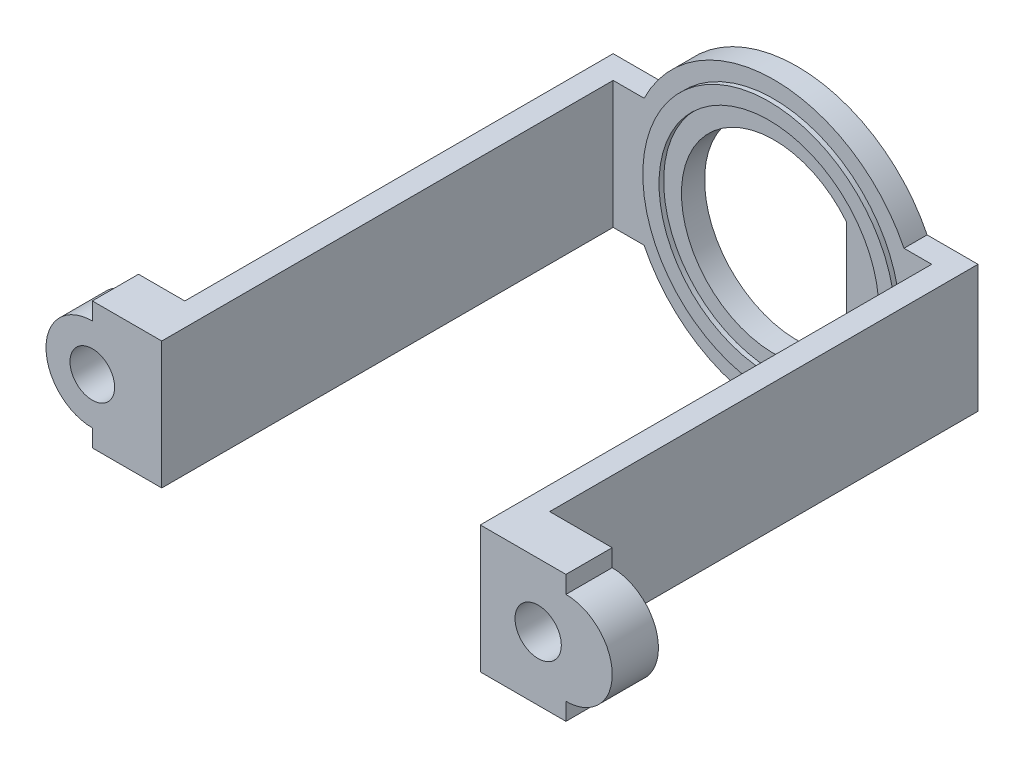
ISO-10303-21;
HEADER;
FILE_DESCRIPTION(('STEP AP214'),'2;1');
FILE_NAME('part.step','',(''),(''),'','','');
FILE_SCHEMA(('AUTOMOTIVE_DESIGN { 1 0 10303 214 1 1 1 1 }'));
ENDSEC;
DATA;
#1=APPLICATION_CONTEXT('core data for automotive mechanical design processes');
#2=APPLICATION_PROTOCOL_DEFINITION('international standard','automotive_design',2000,#1);
#3=PRODUCT_CONTEXT('',#1,'mechanical');
#4=PRODUCT('Part','Part','',(#3));
#5=PRODUCT_RELATED_PRODUCT_CATEGORY('part','',(#4));
#6=PRODUCT_DEFINITION_FORMATION('','',#4);
#7=PRODUCT_DEFINITION_CONTEXT('part definition',#1,'design');
#8=PRODUCT_DEFINITION('design','',#6,#7);
#9=PRODUCT_DEFINITION_SHAPE('','',#8);
#10=(LENGTH_UNIT() NAMED_UNIT(*) SI_UNIT(.MILLI.,.METRE.));
#11=(NAMED_UNIT(*) PLANE_ANGLE_UNIT() SI_UNIT($,.RADIAN.));
#12=(NAMED_UNIT(*) SI_UNIT($,.STERADIAN.) SOLID_ANGLE_UNIT());
#13=UNCERTAINTY_MEASURE_WITH_UNIT(LENGTH_MEASURE(1.E-05),#10,'distance_accuracy_value','');
#14=(GEOMETRIC_REPRESENTATION_CONTEXT(3) GLOBAL_UNCERTAINTY_ASSIGNED_CONTEXT((#13)) GLOBAL_UNIT_ASSIGNED_CONTEXT((#10,
#11,#12)) REPRESENTATION_CONTEXT('',''));
#15=CARTESIAN_POINT('',(0.,0.,0.));
#16=DIRECTION('',(0.,0.,1.));
#17=DIRECTION('',(1.,0.,0.));
#18=AXIS2_PLACEMENT_3D('',#15,#16,#17);
#19=CARTESIAN_POINT('',(0.,0.,1.27));
#20=DIRECTION('',(0.,0.,1.));
#21=DIRECTION('',(1.,0.,0.));
#22=AXIS2_PLACEMENT_3D('',#19,#20,#21);
#23=PLANE('',#22);
#24=DIRECTION('',(1.,0.,0.));
#25=VECTOR('',#24,1.);
#26=CARTESIAN_POINT('',(0.,-6.985,1.27));
#27=LINE('',#26,#25);
#28=CARTESIAN_POINT('',(17.2243573218044,-6.985,1.27));
#29=VERTEX_POINT('',#28);
#30=CARTESIAN_POINT('',(18.7452,-6.985,1.27));
#31=VERTEX_POINT('',#30);
#32=EDGE_CURVE('E328',#29,#31,#27,.T.);
#33=ORIENTED_EDGE('',*,*,#32,.T.);
#34=DIRECTION('',(0.,-1.,0.));
#35=VECTOR('',#34,1.);
#36=CARTESIAN_POINT('',(18.7452,0.,1.27));
#37=LINE('',#36,#35);
#38=CARTESIAN_POINT('',(18.7452,0.,1.27));
#39=VERTEX_POINT('',#38);
#40=EDGE_CURVE('E277',#39,#31,#37,.T.);
#41=ORIENTED_EDGE('',*,*,#40,.F.);
#42=DIRECTION('',(-1.,0.,0.));
#43=VECTOR('',#42,1.);
#44=CARTESIAN_POINT('',(0.,0.,1.27));
#45=LINE('',#44,#43);
#46=CARTESIAN_POINT('',(17.2243573218044,0.,1.27));
#47=VERTEX_POINT('',#46);
#48=EDGE_CURVE('E326',#39,#47,#45,.T.);
#49=ORIENTED_EDGE('',*,*,#48,.T.);
#50=CARTESIAN_POINT('',(10.0965,-3.4925,1.27));
#51=DIRECTION('',(0.,0.,-1.));
#52=DIRECTION('',(-1.,0.,0.));
#53=AXIS2_PLACEMENT_3D('',#50,#51,#52);
#54=CIRCLE('',#53,7.9375);
#55=CARTESIAN_POINT('',(2.96864267819564,0.,1.27));
#56=VERTEX_POINT('',#55);
#57=EDGE_CURVE('E406',#56,#47,#54,.T.);
#58=ORIENTED_EDGE('',*,*,#57,.F.);
#59=CARTESIAN_POINT('',(1.27,0.,1.27));
#60=VERTEX_POINT('',#59);
#61=EDGE_CURVE('E324',#56,#60,#45,.T.);
#62=ORIENTED_EDGE('',*,*,#61,.T.);
#63=DIRECTION('',(0.,1.,0.));
#64=VECTOR('',#63,1.);
#65=CARTESIAN_POINT('',(1.27,0.,1.27));
#66=LINE('',#65,#64);
#67=CARTESIAN_POINT('',(1.27,-6.985,1.27));
#68=VERTEX_POINT('',#67);
#69=EDGE_CURVE('E290',#68,#60,#66,.T.);
#70=ORIENTED_EDGE('',*,*,#69,.F.);
#71=CARTESIAN_POINT('',(2.96864267819564,-6.985,1.27));
#72=VERTEX_POINT('',#71);
#73=EDGE_CURVE('E299',#68,#72,#27,.T.);
#74=ORIENTED_EDGE('',*,*,#73,.T.);
#75=EDGE_CURVE('E405',#29,#72,#54,.T.);
#76=ORIENTED_EDGE('',*,*,#75,.F.);
#77=EDGE_LOOP('',(#33,#41,#49,#58,#62,#70,#74,#76));
#78=FACE_BOUND('',#77,.T.);
#79=CARTESIAN_POINT('',(10.0725111111111,-3.39372222222231,1.27));
#80=DIRECTION('',(0.,0.,1.));
#81=DIRECTION('',(1.,0.,0.));
#82=AXIS2_PLACEMENT_3D('',#79,#80,#81);
#83=CIRCLE('',#82,6.9215);
#84=CARTESIAN_POINT('',(16.9940111111111,-3.39372222222231,1.27));
#85=VERTEX_POINT('',#84);
#86=EDGE_CURVE('E823',#85,#85,#83,.T.);
#87=ORIENTED_EDGE('',*,*,#86,.F.);
#88=EDGE_LOOP('',(#87));
#89=FACE_BOUND('',#88,.T.);
#90=ADVANCED_FACE('F35',(#78,#89),#23,.T.);
#91=CARTESIAN_POINT('',(0.,-6.985,1.27));
#92=DIRECTION('',(0.,1.,0.));
#93=DIRECTION('',(-1.,0.,0.));
#94=AXIS2_PLACEMENT_3D('',#91,#92,#93);
#95=PLANE('',#94);
#96=DIRECTION('',(0.,0.,-1.));
#97=VECTOR('',#96,1.);
#98=CARTESIAN_POINT('',(23.4442,-6.985,112.990742134563));
#99=LINE('',#98,#97);
#100=CARTESIAN_POINT('',(23.4442,-6.985,26.035));
#101=VERTEX_POINT('',#100);
#102=CARTESIAN_POINT('',(23.4442,-6.985,23.4995854901961));
#103=VERTEX_POINT('',#102);
#104=EDGE_CURVE('E198',#101,#103,#99,.T.);
#105=ORIENTED_EDGE('',*,*,#104,.F.);
#106=DIRECTION('',(1.,0.,0.));
#107=VECTOR('',#106,1.);
#108=CARTESIAN_POINT('',(20.0152,-6.985,26.035));
#109=LINE('',#108,#107);
#110=CARTESIAN_POINT('',(18.7452,-6.985,26.035));
#111=VERTEX_POINT('',#110);
#112=EDGE_CURVE('E279',#111,#101,#109,.T.);
#113=ORIENTED_EDGE('',*,*,#112,.F.);
#114=DIRECTION('',(0.,0.,-1.));
#115=VECTOR('',#114,1.);
#116=CARTESIAN_POINT('',(18.7452,-6.985,26.035));
#117=LINE('',#116,#115);
#118=EDGE_CURVE('E286',#111,#31,#117,.T.);
#119=ORIENTED_EDGE('',*,*,#118,.T.);
#120=ORIENTED_EDGE('',*,*,#32,.F.);
#121=DIRECTION('',(0.,0.,-1.));
#122=VECTOR('',#121,1.);
#123=CARTESIAN_POINT('',(17.2243573218044,-6.985,1.27));
#124=LINE('',#123,#122);
#125=CARTESIAN_POINT('',(17.2243573218044,-6.985,0.));
#126=VERTEX_POINT('',#125);
#127=EDGE_CURVE('E417',#29,#126,#124,.T.);
#128=ORIENTED_EDGE('',*,*,#127,.T.);
#129=DIRECTION('',(1.,0.,0.));
#130=VECTOR('',#129,1.);
#131=CARTESIAN_POINT('',(0.,-6.985,0.));
#132=LINE('',#131,#130);
#133=CARTESIAN_POINT('',(20.0152,-6.985,0.));
#134=VERTEX_POINT('',#133);
#135=EDGE_CURVE('E421',#126,#134,#132,.T.);
#136=ORIENTED_EDGE('',*,*,#135,.T.);
#137=DIRECTION('',(0.,0.,-1.));
#138=VECTOR('',#137,1.);
#139=CARTESIAN_POINT('',(20.0152,-6.985,1.27));
#140=LINE('',#139,#138);
#141=CARTESIAN_POINT('',(20.0152,-6.985,23.4995854901961));
#142=VERTEX_POINT('',#141);
#143=EDGE_CURVE('E249',#142,#134,#140,.T.);
#144=ORIENTED_EDGE('',*,*,#143,.F.);
#145=DIRECTION('',(-1.,0.,0.));
#146=VECTOR('',#145,1.);
#147=CARTESIAN_POINT('',(25.9842,-6.985,23.4995854901961));
#148=LINE('',#147,#146);
#149=EDGE_CURVE('E259',#103,#142,#148,.T.);
#150=ORIENTED_EDGE('',*,*,#149,.F.);
#151=EDGE_LOOP('',(#105,#113,#119,#120,#128,#136,#144,#150));
#152=FACE_BOUND('',#151,.T.);
#153=ADVANCED_FACE('F443',(#152),#95,.F.);
#154=CARTESIAN_POINT('',(0.,0.,1.27));
#155=DIRECTION('',(0.,-1.,0.));
#156=DIRECTION('',(0.,0.,-1.));
#157=AXIS2_PLACEMENT_3D('',#154,#155,#156);
#158=PLANE('',#157);
#159=DIRECTION('',(0.,0.,-1.));
#160=VECTOR('',#159,1.);
#161=CARTESIAN_POINT('',(23.4442,0.,112.990742134563));
#162=LINE('',#161,#160);
#163=CARTESIAN_POINT('',(23.4442,0.,26.035));
#164=VERTEX_POINT('',#163);
#165=CARTESIAN_POINT('',(23.4442,0.,23.4995854901961));
#166=VERTEX_POINT('',#165);
#167=EDGE_CURVE('E190',#164,#166,#162,.T.);
#168=ORIENTED_EDGE('',*,*,#167,.T.);
#169=DIRECTION('',(-1.,0.,0.));
#170=VECTOR('',#169,1.);
#171=CARTESIAN_POINT('',(25.9842,0.,23.4995854901961));
#172=LINE('',#171,#170);
#173=CARTESIAN_POINT('',(20.0152,0.,23.4995854901961));
#174=VERTEX_POINT('',#173);
#175=EDGE_CURVE('E248',#166,#174,#172,.T.);
#176=ORIENTED_EDGE('',*,*,#175,.T.);
#177=DIRECTION('',(0.,0.,-1.));
#178=VECTOR('',#177,1.);
#179=CARTESIAN_POINT('',(20.0152,0.,1.27));
#180=LINE('',#179,#178);
#181=CARTESIAN_POINT('',(20.0152,0.,0.));
#182=VERTEX_POINT('',#181);
#183=EDGE_CURVE('E333',#174,#182,#180,.T.);
#184=ORIENTED_EDGE('',*,*,#183,.T.);
#185=DIRECTION('',(-1.,0.,0.));
#186=VECTOR('',#185,1.);
#187=CARTESIAN_POINT('',(0.,0.,0.));
#188=LINE('',#187,#186);
#189=CARTESIAN_POINT('',(17.2243573218044,0.,0.));
#190=VERTEX_POINT('',#189);
#191=EDGE_CURVE('E426',#182,#190,#188,.T.);
#192=ORIENTED_EDGE('',*,*,#191,.T.);
#193=DIRECTION('',(0.,0.,-1.));
#194=VECTOR('',#193,1.);
#195=CARTESIAN_POINT('',(17.2243573218044,0.,1.27));
#196=LINE('',#195,#194);
#197=EDGE_CURVE('E409',#190,#47,#196,.F.);
#198=ORIENTED_EDGE('',*,*,#197,.T.);
#199=ORIENTED_EDGE('',*,*,#48,.F.);
#200=DIRECTION('',(0.,0.,-1.));
#201=VECTOR('',#200,1.);
#202=CARTESIAN_POINT('',(18.7452,0.,26.035));
#203=LINE('',#202,#201);
#204=CARTESIAN_POINT('',(18.7452,0.,26.035));
#205=VERTEX_POINT('',#204);
#206=EDGE_CURVE('E274',#205,#39,#203,.T.);
#207=ORIENTED_EDGE('',*,*,#206,.F.);
#208=DIRECTION('',(-1.,0.,0.));
#209=VECTOR('',#208,1.);
#210=CARTESIAN_POINT('',(20.0152,0.,26.035));
#211=LINE('',#210,#209);
#212=EDGE_CURVE('E268',#164,#205,#211,.T.);
#213=ORIENTED_EDGE('',*,*,#212,.F.);
#214=EDGE_LOOP('',(#168,#176,#184,#192,#198,#199,#207,#213));
#215=FACE_BOUND('',#214,.T.);
#216=ADVANCED_FACE('F271',(#215),#158,.F.);
#217=CARTESIAN_POINT('',(20.0152,-6.985,26.035));
#218=DIRECTION('',(0.,0.,-1.));
#219=DIRECTION('',(-1.,0.,0.));
#220=AXIS2_PLACEMENT_3D('',#217,#218,#219);
#221=PLANE('',#220);
#222=CARTESIAN_POINT('',(21.9202,-3.4925,26.035));
#223=DIRECTION('',(0.,0.,1.));
#224=DIRECTION('',(1.,0.,0.));
#225=AXIS2_PLACEMENT_3D('',#222,#223,#224);
#226=CIRCLE('',#225,1.27);
#227=CARTESIAN_POINT('',(23.1902,-3.4925,26.035));
#228=VERTEX_POINT('',#227);
#229=EDGE_CURVE('E207',#228,#228,#226,.T.);
#230=ORIENTED_EDGE('',*,*,#229,.F.);
#231=EDGE_LOOP('',(#230));
#232=FACE_BOUND('',#231,.T.);
#233=DIRECTION('',(0.,-1.,0.));
#234=VECTOR('',#233,1.);
#235=CARTESIAN_POINT('',(23.4442,-6.985,26.035));
#236=LINE('',#235,#234);
#237=CARTESIAN_POINT('',(23.4442,-0.9525,26.035));
#238=VERTEX_POINT('',#237);
#239=EDGE_CURVE('E215',#164,#238,#236,.T.);
#240=ORIENTED_EDGE('',*,*,#239,.F.);
#241=ORIENTED_EDGE('',*,*,#212,.T.);
#242=DIRECTION('',(0.,-1.,0.));
#243=VECTOR('',#242,1.);
#244=CARTESIAN_POINT('',(18.7452,0.,26.035));
#245=LINE('',#244,#243);
#246=EDGE_CURVE('E276',#205,#111,#245,.T.);
#247=ORIENTED_EDGE('',*,*,#246,.T.);
#248=ORIENTED_EDGE('',*,*,#112,.T.);
#249=DIRECTION('',(0.,-1.,0.));
#250=VECTOR('',#249,1.);
#251=CARTESIAN_POINT('',(23.4442,-6.985,26.035));
#252=LINE('',#251,#250);
#253=CARTESIAN_POINT('',(23.4442,-6.0325,26.035));
#254=VERTEX_POINT('',#253);
#255=EDGE_CURVE('E213',#254,#101,#252,.T.);
#256=ORIENTED_EDGE('',*,*,#255,.F.);
#257=CARTESIAN_POINT('',(23.4442,-3.4925,26.035));
#258=DIRECTION('',(0.,0.,-1.));
#259=DIRECTION('',(-1.,0.,0.));
#260=AXIS2_PLACEMENT_3D('',#257,#258,#259);
#261=CIRCLE('',#260,2.54);
#262=EDGE_CURVE('E50',#238,#254,#261,.T.);
#263=ORIENTED_EDGE('',*,*,#262,.F.);
#264=EDGE_LOOP('',(#240,#241,#247,#248,#256,#263));
#265=FACE_BOUND('',#264,.T.);
#266=ADVANCED_FACE('F267',(#232,#265),#221,.F.);
#267=CARTESIAN_POINT('',(25.9842,0.,23.4995854901961));
#268=DIRECTION('',(0.,0.,1.));
#269=DIRECTION('',(1.,0.,0.));
#270=AXIS2_PLACEMENT_3D('',#267,#268,#269);
#271=PLANE('',#270);
#272=CARTESIAN_POINT('',(21.9202,-3.4925,23.4995854901961));
#273=DIRECTION('',(0.,0.,1.));
#274=DIRECTION('',(1.,0.,0.));
#275=AXIS2_PLACEMENT_3D('',#272,#273,#274);
#276=CIRCLE('',#275,1.27);
#277=CARTESIAN_POINT('',(23.1902,-3.4925,23.4995854901961));
#278=VERTEX_POINT('',#277);
#279=EDGE_CURVE('E202',#278,#278,#276,.T.);
#280=ORIENTED_EDGE('',*,*,#279,.T.);
#281=EDGE_LOOP('',(#280));
#282=FACE_BOUND('',#281,.T.);
#283=DIRECTION('',(0.,1.,0.));
#284=VECTOR('',#283,1.);
#285=CARTESIAN_POINT('',(23.4442,0.,23.4995854901961));
#286=LINE('',#285,#284);
#287=CARTESIAN_POINT('',(23.4442,-0.9525,23.4995854901961));
#288=VERTEX_POINT('',#287);
#289=EDGE_CURVE('E43',#288,#166,#286,.T.);
#290=ORIENTED_EDGE('',*,*,#289,.F.);
#291=CARTESIAN_POINT('',(23.4442,-3.4925,23.4995854901961));
#292=DIRECTION('',(0.,0.,1.));
#293=DIRECTION('',(1.,0.,0.));
#294=AXIS2_PLACEMENT_3D('',#291,#292,#293);
#295=CIRCLE('',#294,2.54);
#296=CARTESIAN_POINT('',(23.4442,-6.0325,23.4995854901961));
#297=VERTEX_POINT('',#296);
#298=EDGE_CURVE('E182',#297,#288,#295,.T.);
#299=ORIENTED_EDGE('',*,*,#298,.F.);
#300=DIRECTION('',(0.,1.,0.));
#301=VECTOR('',#300,1.);
#302=CARTESIAN_POINT('',(23.4442,0.,23.4995854901961));
#303=LINE('',#302,#301);
#304=EDGE_CURVE('E185',#103,#297,#303,.T.);
#305=ORIENTED_EDGE('',*,*,#304,.F.);
#306=ORIENTED_EDGE('',*,*,#149,.T.);
#307=DIRECTION('',(0.,1.,0.));
#308=VECTOR('',#307,1.);
#309=CARTESIAN_POINT('',(20.0152,0.,23.4995854901961));
#310=LINE('',#309,#308);
#311=EDGE_CURVE('E239',#142,#174,#310,.T.);
#312=ORIENTED_EDGE('',*,*,#311,.T.);
#313=ORIENTED_EDGE('',*,*,#175,.F.);
#314=EDGE_LOOP('',(#290,#299,#305,#306,#312,#313));
#315=FACE_BOUND('',#314,.T.);
#316=ADVANCED_FACE('F184',(#282,#315),#271,.F.);
#317=CARTESIAN_POINT('',(20.0152,0.,1.27));
#318=DIRECTION('',(-1.,0.,0.));
#319=DIRECTION('',(0.,0.,1.));
#320=AXIS2_PLACEMENT_3D('',#317,#318,#319);
#321=PLANE('',#320);
#322=ORIENTED_EDGE('',*,*,#311,.F.);
#323=ORIENTED_EDGE('',*,*,#143,.T.);
#324=DIRECTION('',(0.,1.,0.));
#325=VECTOR('',#324,1.);
#326=CARTESIAN_POINT('',(20.0152,0.,0.));
#327=LINE('',#326,#325);
#328=EDGE_CURVE('E424',#134,#182,#327,.T.);
#329=ORIENTED_EDGE('',*,*,#328,.T.);
#330=ORIENTED_EDGE('',*,*,#183,.F.);
#331=EDGE_LOOP('',(#322,#323,#329,#330));
#332=FACE_BOUND('',#331,.T.);
#333=ADVANCED_FACE('F483',(#332),#321,.F.);
#334=CARTESIAN_POINT('',(0.,0.,1.27));
#335=DIRECTION('',(1.,0.,0.));
#336=DIRECTION('',(0.,1.,0.));
#337=AXIS2_PLACEMENT_3D('',#334,#335,#336);
#338=PLANE('',#337);
#339=DIRECTION('',(0.,-1.,0.));
#340=VECTOR('',#339,1.);
#341=CARTESIAN_POINT('',(0.,0.,23.4995879248366));
#342=LINE('',#341,#340);
#343=CARTESIAN_POINT('',(0.,0.,23.4995879248366));
#344=VERTEX_POINT('',#343);
#345=CARTESIAN_POINT('',(0.,-6.985,23.4995879248366));
#346=VERTEX_POINT('',#345);
#347=EDGE_CURVE('E261',#344,#346,#342,.T.);
#348=ORIENTED_EDGE('',*,*,#347,.F.);
#349=DIRECTION('',(0.,0.,-1.));
#350=VECTOR('',#349,1.);
#351=CARTESIAN_POINT('',(0.,0.,1.27));
#352=LINE('',#351,#350);
#353=CARTESIAN_POINT('',(0.,0.,0.));
#354=VERTEX_POINT('',#353);
#355=EDGE_CURVE('E318',#344,#354,#352,.T.);
#356=ORIENTED_EDGE('',*,*,#355,.T.);
#357=DIRECTION('',(0.,-1.,0.));
#358=VECTOR('',#357,1.);
#359=CARTESIAN_POINT('',(0.,0.,0.));
#360=LINE('',#359,#358);
#361=CARTESIAN_POINT('',(0.,-6.985,0.));
#362=VERTEX_POINT('',#361);
#363=EDGE_CURVE('E365',#354,#362,#360,.T.);
#364=ORIENTED_EDGE('',*,*,#363,.T.);
#365=DIRECTION('',(0.,0.,-1.));
#366=VECTOR('',#365,1.);
#367=CARTESIAN_POINT('',(0.,-6.985,1.27));
#368=LINE('',#367,#366);
#369=EDGE_CURVE('E314',#346,#362,#368,.T.);
#370=ORIENTED_EDGE('',*,*,#369,.F.);
#371=EDGE_LOOP('',(#348,#356,#364,#370));
#372=FACE_BOUND('',#371,.T.);
#373=ADVANCED_FACE('F37',(#372),#338,.F.);
#374=CARTESIAN_POINT('',(10.0725111111111,-3.39372222222231,1.27));
#375=DIRECTION('',(0.,0.,1.));
#376=DIRECTION('',(1.,0.,0.));
#377=AXIS2_PLACEMENT_3D('',#374,#375,#376);
#378=CIRCLE('',#377,6.0325);
#379=CARTESIAN_POINT('',(16.1050111111111,-3.39372222222231,1.27));
#380=VERTEX_POINT('',#379);
#381=EDGE_CURVE('E11',#380,#380,#378,.F.);
#382=ORIENTED_EDGE('',*,*,#381,.F.);
#383=EDGE_LOOP('',(#382));
#384=FACE_BOUND('',#383,.T.);
#385=CARTESIAN_POINT('',(10.0965,-3.4925,1.27));
#386=DIRECTION('',(0.,0.,1.));
#387=DIRECTION('',(1.,0.,0.));
#388=AXIS2_PLACEMENT_3D('',#385,#386,#387);
#389=CIRCLE('',#388,5.08);
#390=CARTESIAN_POINT('',(14.062073728983,-0.317500000000002,1.27));
#391=VERTEX_POINT('',#390);
#392=CARTESIAN_POINT('',(14.062073728983,-6.6675,1.27));
#393=VERTEX_POINT('',#392);
#394=EDGE_CURVE('E398',#391,#393,#389,.T.);
#395=ORIENTED_EDGE('',*,*,#394,.F.);
#396=DIRECTION('',(0.,1.,0.));
#397=VECTOR('',#396,1.);
#398=CARTESIAN_POINT('',(14.062073728983,0.,1.27));
#399=LINE('',#398,#397);
#400=EDGE_CURVE('E394',#393,#391,#399,.T.);
#401=ORIENTED_EDGE('',*,*,#400,.F.);
#402=EDGE_LOOP('',(#395,#401));
#403=FACE_BOUND('',#402,.T.);
#404=ADVANCED_FACE('F471',(#384,#403),#23,.T.);
#405=DIRECTION('',(1.,0.,0.));
#406=VECTOR('',#405,1.);
#407=CARTESIAN_POINT('',(-5.08,0.,23.4995879248366));
#408=LINE('',#407,#406);
#409=CARTESIAN_POINT('',(-2.53999999999999,0.,23.4995879248366));
#410=VERTEX_POINT('',#409);
#411=EDGE_CURVE('E282',#410,#344,#408,.T.);
#412=ORIENTED_EDGE('',*,*,#411,.F.);
#413=DIRECTION('',(0.,0.,-1.));
#414=VECTOR('',#413,1.);
#415=CARTESIAN_POINT('',(-2.53999999999999,0.,112.990764435649));
#416=LINE('',#415,#414);
#417=CARTESIAN_POINT('',(-2.53999999999999,0.,26.035));
#418=VERTEX_POINT('',#417);
#419=EDGE_CURVE('E227',#418,#410,#416,.T.);
#420=ORIENTED_EDGE('',*,*,#419,.F.);
#421=DIRECTION('',(-1.,0.,0.));
#422=VECTOR('',#421,1.);
#423=CARTESIAN_POINT('',(0.,0.,26.035));
#424=LINE('',#423,#422);
#425=CARTESIAN_POINT('',(1.27,0.,26.035));
#426=VERTEX_POINT('',#425);
#427=EDGE_CURVE('E306',#426,#418,#424,.T.);
#428=ORIENTED_EDGE('',*,*,#427,.F.);
#429=DIRECTION('',(0.,0.,-1.));
#430=VECTOR('',#429,1.);
#431=CARTESIAN_POINT('',(1.27,0.,26.035));
#432=LINE('',#431,#430);
#433=EDGE_CURVE('E302',#426,#60,#432,.T.);
#434=ORIENTED_EDGE('',*,*,#433,.T.);
#435=ORIENTED_EDGE('',*,*,#61,.F.);
#436=DIRECTION('',(0.,0.,-1.));
#437=VECTOR('',#436,1.);
#438=CARTESIAN_POINT('',(2.96864267819564,0.,1.27));
#439=LINE('',#438,#437);
#440=CARTESIAN_POINT('',(2.96864267819564,0.,0.));
#441=VERTEX_POINT('',#440);
#442=EDGE_CURVE('E412',#56,#441,#439,.T.);
#443=ORIENTED_EDGE('',*,*,#442,.T.);
#444=EDGE_CURVE('E360',#441,#354,#188,.T.);
#445=ORIENTED_EDGE('',*,*,#444,.T.);
#446=ORIENTED_EDGE('',*,*,#355,.F.);
#447=EDGE_LOOP('',(#412,#420,#428,#434,#435,#443,#445,#446));
#448=FACE_BOUND('',#447,.T.);
#449=ADVANCED_FACE('F355',(#448),#158,.F.);
#450=DIRECTION('',(1.,0.,0.));
#451=VECTOR('',#450,1.);
#452=CARTESIAN_POINT('',(0.,-6.985,26.035));
#453=LINE('',#452,#451);
#454=CARTESIAN_POINT('',(-2.53999999999999,-6.98500000000001,26.035));
#455=VERTEX_POINT('',#454);
#456=CARTESIAN_POINT('',(1.27,-6.985,26.035));
#457=VERTEX_POINT('',#456);
#458=EDGE_CURVE('E293',#455,#457,#453,.T.);
#459=ORIENTED_EDGE('',*,*,#458,.F.);
#460=DIRECTION('',(0.,0.,-1.));
#461=VECTOR('',#460,1.);
#462=CARTESIAN_POINT('',(-2.53999999999999,-6.98500000000001,112.990764435649));
#463=LINE('',#462,#461);
#464=CARTESIAN_POINT('',(-2.53999999999999,-6.98500000000001,23.4995879248366));
#465=VERTEX_POINT('',#464);
#466=EDGE_CURVE('E221',#455,#465,#463,.T.);
#467=ORIENTED_EDGE('',*,*,#466,.T.);
#468=DIRECTION('',(1.,0.,0.));
#469=VECTOR('',#468,1.);
#470=CARTESIAN_POINT('',(-5.08,-6.985,23.4995879248366));
#471=LINE('',#470,#469);
#472=EDGE_CURVE('E340',#465,#346,#471,.T.);
#473=ORIENTED_EDGE('',*,*,#472,.T.);
#474=ORIENTED_EDGE('',*,*,#369,.T.);
#475=CARTESIAN_POINT('',(2.96864267819564,-6.985,0.));
#476=VERTEX_POINT('',#475);
#477=EDGE_CURVE('E422',#362,#476,#132,.T.);
#478=ORIENTED_EDGE('',*,*,#477,.T.);
#479=DIRECTION('',(0.,0.,-1.));
#480=VECTOR('',#479,1.);
#481=CARTESIAN_POINT('',(2.96864267819564,-6.985,1.27));
#482=LINE('',#481,#480);
#483=EDGE_CURVE('E414',#476,#72,#482,.F.);
#484=ORIENTED_EDGE('',*,*,#483,.T.);
#485=ORIENTED_EDGE('',*,*,#73,.F.);
#486=DIRECTION('',(0.,0.,-1.));
#487=VECTOR('',#486,1.);
#488=CARTESIAN_POINT('',(1.27,-6.985,26.035));
#489=LINE('',#488,#487);
#490=EDGE_CURVE('E305',#457,#68,#489,.T.);
#491=ORIENTED_EDGE('',*,*,#490,.F.);
#492=EDGE_LOOP('',(#459,#467,#473,#474,#478,#484,#485,#491));
#493=FACE_BOUND('',#492,.T.);
#494=ADVANCED_FACE('F369',(#493),#95,.F.);
#495=CARTESIAN_POINT('',(0.,0.,0.));
#496=DIRECTION('',(0.,0.,1.));
#497=DIRECTION('',(1.,0.,0.));
#498=AXIS2_PLACEMENT_3D('',#495,#496,#497);
#499=PLANE('',#498);
#500=DIRECTION('',(0.,-1.,0.));
#501=VECTOR('',#500,1.);
#502=CARTESIAN_POINT('',(14.062073728983,-0.317500000000002,0.));
#503=LINE('',#502,#501);
#504=CARTESIAN_POINT('',(14.062073728983,-0.317500000000002,0.));
#505=VERTEX_POINT('',#504);
#506=CARTESIAN_POINT('',(14.062073728983,-6.6675,0.));
#507=VERTEX_POINT('',#506);
#508=EDGE_CURVE('E388',#505,#507,#503,.T.);
#509=ORIENTED_EDGE('',*,*,#508,.F.);
#510=CARTESIAN_POINT('',(10.0965,-3.4925,0.));
#511=DIRECTION('',(0.,0.,-1.));
#512=DIRECTION('',(1.,0.,0.));
#513=AXIS2_PLACEMENT_3D('',#510,#511,#512);
#514=CIRCLE('',#513,5.08);
#515=EDGE_CURVE('E311',#507,#505,#514,.T.);
#516=ORIENTED_EDGE('',*,*,#515,.F.);
#517=EDGE_LOOP('',(#509,#516));
#518=FACE_BOUND('',#517,.T.);
#519=ORIENTED_EDGE('',*,*,#135,.F.);
#520=CARTESIAN_POINT('',(10.0965,-3.4925,0.));
#521=DIRECTION('',(0.,0.,-1.));
#522=DIRECTION('',(-1.,0.,0.));
#523=AXIS2_PLACEMENT_3D('',#520,#521,#522);
#524=CIRCLE('',#523,7.9375);
#525=EDGE_CURVE('E401',#126,#476,#524,.T.);
#526=ORIENTED_EDGE('',*,*,#525,.T.);
#527=ORIENTED_EDGE('',*,*,#477,.F.);
#528=ORIENTED_EDGE('',*,*,#363,.F.);
#529=ORIENTED_EDGE('',*,*,#444,.F.);
#530=EDGE_CURVE('E402',#441,#190,#524,.T.);
#531=ORIENTED_EDGE('',*,*,#530,.T.);
#532=ORIENTED_EDGE('',*,*,#191,.F.);
#533=ORIENTED_EDGE('',*,*,#328,.F.);
#534=EDGE_LOOP('',(#519,#526,#527,#528,#529,#531,#532,#533));
#535=FACE_BOUND('',#534,.T.);
#536=ADVANCED_FACE('F493',(#518,#535),#499,.F.);
#537=CARTESIAN_POINT('',(10.0965,-3.4925,1.27));
#538=DIRECTION('',(0.,0.,-1.));
#539=DIRECTION('',(-1.,0.,0.));
#540=AXIS2_PLACEMENT_3D('',#537,#538,#539);
#541=CYLINDRICAL_SURFACE('',#540,7.9375);
#542=ORIENTED_EDGE('',*,*,#442,.F.);
#543=ORIENTED_EDGE('',*,*,#57,.T.);
#544=ORIENTED_EDGE('',*,*,#197,.F.);
#545=ORIENTED_EDGE('',*,*,#530,.F.);
#546=EDGE_LOOP('',(#542,#543,#544,#545));
#547=FACE_BOUND('',#546,.T.);
#548=ADVANCED_FACE('F454',(#547),#541,.T.);
#549=ORIENTED_EDGE('',*,*,#127,.F.);
#550=ORIENTED_EDGE('',*,*,#75,.T.);
#551=ORIENTED_EDGE('',*,*,#483,.F.);
#552=ORIENTED_EDGE('',*,*,#525,.F.);
#553=EDGE_LOOP('',(#549,#550,#551,#552));
#554=FACE_BOUND('',#553,.T.);
#555=ADVANCED_FACE('F440',(#554),#541,.T.);
#556=CARTESIAN_POINT('',(10.0965,-3.4925,2.54));
#557=DIRECTION('',(0.,0.,-1.));
#558=DIRECTION('',(-1.,0.,0.));
#559=AXIS2_PLACEMENT_3D('',#556,#557,#558);
#560=CYLINDRICAL_SURFACE('',#559,5.08);
#561=ORIENTED_EDGE('',*,*,#394,.T.);
#562=DIRECTION('',(0.,0.,-1.));
#563=VECTOR('',#562,1.);
#564=CARTESIAN_POINT('',(14.062073728983,-6.6675,2.54));
#565=LINE('',#564,#563);
#566=EDGE_CURVE('E392',#393,#507,#565,.T.);
#567=ORIENTED_EDGE('',*,*,#566,.T.);
#568=ORIENTED_EDGE('',*,*,#515,.T.);
#569=DIRECTION('',(0.,0.,-1.));
#570=VECTOR('',#569,1.);
#571=CARTESIAN_POINT('',(14.062073728983,-0.317500000000002,2.54));
#572=LINE('',#571,#570);
#573=EDGE_CURVE('E391',#391,#505,#572,.T.);
#574=ORIENTED_EDGE('',*,*,#573,.F.);
#575=EDGE_LOOP('',(#561,#567,#568,#574));
#576=FACE_BOUND('',#575,.T.);
#577=ADVANCED_FACE('F466',(#576),#560,.F.);
#578=CARTESIAN_POINT('',(14.062073728983,-0.317500000000002,2.54));
#579=DIRECTION('',(1.,0.,0.));
#580=DIRECTION('',(0.,0.,-1.));
#581=AXIS2_PLACEMENT_3D('',#578,#579,#580);
#582=PLANE('',#581);
#583=ORIENTED_EDGE('',*,*,#400,.T.);
#584=ORIENTED_EDGE('',*,*,#573,.T.);
#585=ORIENTED_EDGE('',*,*,#508,.T.);
#586=ORIENTED_EDGE('',*,*,#566,.F.);
#587=EDGE_LOOP('',(#583,#584,#585,#586));
#588=FACE_BOUND('',#587,.T.);
#589=ADVANCED_FACE('F458',(#588),#582,.F.);
#590=CARTESIAN_POINT('',(1.27,0.,26.035));
#591=DIRECTION('',(-1.,0.,0.));
#592=DIRECTION('',(0.,-1.,0.));
#593=AXIS2_PLACEMENT_3D('',#590,#591,#592);
#594=PLANE('',#593);
#595=ORIENTED_EDGE('',*,*,#69,.T.);
#596=ORIENTED_EDGE('',*,*,#433,.F.);
#597=DIRECTION('',(0.,1.,0.));
#598=VECTOR('',#597,1.);
#599=CARTESIAN_POINT('',(1.27,0.,26.035));
#600=LINE('',#599,#598);
#601=EDGE_CURVE('E383',#457,#426,#600,.T.);
#602=ORIENTED_EDGE('',*,*,#601,.F.);
#603=ORIENTED_EDGE('',*,*,#490,.T.);
#604=EDGE_LOOP('',(#595,#596,#602,#603));
#605=FACE_BOUND('',#604,.T.);
#606=ADVANCED_FACE('F456',(#605),#594,.F.);
#607=CARTESIAN_POINT('',(0.,-6.985,26.035));
#608=DIRECTION('',(0.,0.,1.));
#609=DIRECTION('',(1.,0.,0.));
#610=AXIS2_PLACEMENT_3D('',#607,#608,#609);
#611=PLANE('',#610);
#612=CARTESIAN_POINT('',(-2.54,-3.4925,26.035));
#613=DIRECTION('',(0.,0.,1.));
#614=DIRECTION('',(1.,0.,0.));
#615=AXIS2_PLACEMENT_3D('',#612,#613,#614);
#616=CIRCLE('',#615,1.22484545751634);
#617=CARTESIAN_POINT('',(-1.31515454248366,-3.4925,26.035));
#618=VERTEX_POINT('',#617);
#619=EDGE_CURVE('E217',#618,#618,#616,.T.);
#620=ORIENTED_EDGE('',*,*,#619,.F.);
#621=EDGE_LOOP('',(#620));
#622=FACE_BOUND('',#621,.T.);
#623=DIRECTION('',(0.,1.,0.));
#624=VECTOR('',#623,1.);
#625=CARTESIAN_POINT('',(-2.54000000000004,-6.98499999999998,26.035));
#626=LINE('',#625,#624);
#627=CARTESIAN_POINT('',(-2.54,-0.952499999999998,26.035));
#628=VERTEX_POINT('',#627);
#629=EDGE_CURVE('E237',#628,#418,#626,.T.);
#630=ORIENTED_EDGE('',*,*,#629,.F.);
#631=CARTESIAN_POINT('',(-2.54,-3.4925,26.035));
#632=DIRECTION('',(0.,0.,1.));
#633=DIRECTION('',(1.,0.,0.));
#634=AXIS2_PLACEMENT_3D('',#631,#632,#633);
#635=CIRCLE('',#634,2.54);
#636=CARTESIAN_POINT('',(-2.54,-6.0325,26.035));
#637=VERTEX_POINT('',#636);
#638=EDGE_CURVE('E233',#637,#628,#635,.F.);
#639=ORIENTED_EDGE('',*,*,#638,.F.);
#640=DIRECTION('',(0.,1.,0.));
#641=VECTOR('',#640,1.);
#642=CARTESIAN_POINT('',(-2.53999999999999,-6.98500000000002,26.035));
#643=LINE('',#642,#641);
#644=EDGE_CURVE('E235',#455,#637,#643,.T.);
#645=ORIENTED_EDGE('',*,*,#644,.F.);
#646=ORIENTED_EDGE('',*,*,#458,.T.);
#647=ORIENTED_EDGE('',*,*,#601,.T.);
#648=ORIENTED_EDGE('',*,*,#427,.T.);
#649=EDGE_LOOP('',(#630,#639,#645,#646,#647,#648));
#650=FACE_BOUND('',#649,.T.);
#651=ADVANCED_FACE('F381',(#622,#650),#611,.T.);
#652=CARTESIAN_POINT('',(18.7452,0.,26.035));
#653=DIRECTION('',(1.,0.,0.));
#654=DIRECTION('',(0.,0.,-1.));
#655=AXIS2_PLACEMENT_3D('',#652,#653,#654);
#656=PLANE('',#655);
#657=ORIENTED_EDGE('',*,*,#40,.T.);
#658=ORIENTED_EDGE('',*,*,#118,.F.);
#659=ORIENTED_EDGE('',*,*,#246,.F.);
#660=ORIENTED_EDGE('',*,*,#206,.T.);
#661=EDGE_LOOP('',(#657,#658,#659,#660));
#662=FACE_BOUND('',#661,.T.);
#663=ADVANCED_FACE('F449',(#662),#656,.F.);
#664=CARTESIAN_POINT('',(-5.08,0.,23.4995879248366));
#665=DIRECTION('',(0.,0.,1.));
#666=DIRECTION('',(1.,0.,0.));
#667=AXIS2_PLACEMENT_3D('',#664,#665,#666);
#668=PLANE('',#667);
#669=CARTESIAN_POINT('',(-2.54,-3.4925,23.4995879248366));
#670=DIRECTION('',(0.,0.,1.));
#671=DIRECTION('',(1.,0.,0.));
#672=AXIS2_PLACEMENT_3D('',#669,#670,#671);
#673=CIRCLE('',#672,1.22484545751634);
#674=CARTESIAN_POINT('',(-1.31515454248366,-3.4925,23.4995879248366));
#675=VERTEX_POINT('',#674);
#676=EDGE_CURVE('E220',#675,#675,#673,.T.);
#677=ORIENTED_EDGE('',*,*,#676,.T.);
#678=EDGE_LOOP('',(#677));
#679=FACE_BOUND('',#678,.T.);
#680=CARTESIAN_POINT('',(-2.54,-3.4925,23.4995879248366));
#681=DIRECTION('',(0.,0.,1.));
#682=DIRECTION('',(1.,0.,0.));
#683=AXIS2_PLACEMENT_3D('',#680,#681,#682);
#684=CIRCLE('',#683,2.54);
#685=CARTESIAN_POINT('',(-2.54,-6.0325,23.4995879248366));
#686=VERTEX_POINT('',#685);
#687=CARTESIAN_POINT('',(-2.54,-0.952499999999998,23.4995879248366));
#688=VERTEX_POINT('',#687);
#689=EDGE_CURVE('E229',#686,#688,#684,.F.);
#690=ORIENTED_EDGE('',*,*,#689,.T.);
#691=DIRECTION('',(0.,1.,0.));
#692=VECTOR('',#691,1.);
#693=CARTESIAN_POINT('',(-2.53999999999999,0.,23.4995879248366));
#694=LINE('',#693,#692);
#695=EDGE_CURVE('E199',#688,#410,#694,.T.);
#696=ORIENTED_EDGE('',*,*,#695,.T.);
#697=ORIENTED_EDGE('',*,*,#411,.T.);
#698=ORIENTED_EDGE('',*,*,#347,.T.);
#699=ORIENTED_EDGE('',*,*,#472,.F.);
#700=DIRECTION('',(0.,1.,0.));
#701=VECTOR('',#700,1.);
#702=CARTESIAN_POINT('',(-2.54000000000004,0.,23.4995879248366));
#703=LINE('',#702,#701);
#704=EDGE_CURVE('E317',#465,#686,#703,.T.);
#705=ORIENTED_EDGE('',*,*,#704,.T.);
#706=EDGE_LOOP('',(#690,#696,#697,#698,#699,#705));
#707=FACE_BOUND('',#706,.T.);
#708=ADVANCED_FACE('F346',(#679,#707),#668,.F.);
#709=CARTESIAN_POINT('',(-2.54,-0.952499999999998,112.990764435649));
#710=DIRECTION('',(1.,0.,0.));
#711=DIRECTION('',(0.,1.,0.));
#712=AXIS2_PLACEMENT_3D('',#709,#710,#711);
#713=PLANE('',#712);
#714=DIRECTION('',(0.,0.,-1.));
#715=VECTOR('',#714,1.);
#716=CARTESIAN_POINT('',(-2.54,-0.952499999999998,112.990764435649));
#717=LINE('',#716,#715);
#718=EDGE_CURVE('E224',#628,#688,#717,.T.);
#719=ORIENTED_EDGE('',*,*,#718,.F.);
#720=ORIENTED_EDGE('',*,*,#629,.T.);
#721=ORIENTED_EDGE('',*,*,#419,.T.);
#722=ORIENTED_EDGE('',*,*,#695,.F.);
#723=EDGE_LOOP('',(#719,#720,#721,#722));
#724=FACE_BOUND('',#723,.T.);
#725=ADVANCED_FACE('F379',(#724),#713,.F.);
#726=CARTESIAN_POINT('',(-2.54,-6.0325,112.990764435649));
#727=DIRECTION('',(1.,0.,0.));
#728=DIRECTION('',(0.,1.,0.));
#729=AXIS2_PLACEMENT_3D('',#726,#727,#728);
#730=PLANE('',#729);
#731=ORIENTED_EDGE('',*,*,#466,.F.);
#732=ORIENTED_EDGE('',*,*,#644,.T.);
#733=DIRECTION('',(0.,0.,-1.));
#734=VECTOR('',#733,1.);
#735=CARTESIAN_POINT('',(-2.54,-6.0325,112.990764435649));
#736=LINE('',#735,#734);
#737=EDGE_CURVE('E225',#637,#686,#736,.T.);
#738=ORIENTED_EDGE('',*,*,#737,.T.);
#739=ORIENTED_EDGE('',*,*,#704,.F.);
#740=EDGE_LOOP('',(#731,#732,#738,#739));
#741=FACE_BOUND('',#740,.T.);
#742=ADVANCED_FACE('F372',(#741),#730,.F.);
#743=CARTESIAN_POINT('',(-2.54,-3.4925,112.990764435649));
#744=DIRECTION('',(0.,0.,-1.));
#745=DIRECTION('',(-1.,0.,0.));
#746=AXIS2_PLACEMENT_3D('',#743,#744,#745);
#747=CYLINDRICAL_SURFACE('',#746,2.54);
#748=ORIENTED_EDGE('',*,*,#737,.F.);
#749=ORIENTED_EDGE('',*,*,#638,.T.);
#750=ORIENTED_EDGE('',*,*,#718,.T.);
#751=ORIENTED_EDGE('',*,*,#689,.F.);
#752=EDGE_LOOP('',(#748,#749,#750,#751));
#753=FACE_BOUND('',#752,.T.);
#754=ADVANCED_FACE('F377',(#753),#747,.T.);
#755=CARTESIAN_POINT('',(-2.54,-3.4925,20.066));
#756=DIRECTION('',(0.,0.,1.));
#757=DIRECTION('',(1.,0.,0.));
#758=AXIS2_PLACEMENT_3D('',#755,#756,#757);
#759=CYLINDRICAL_SURFACE('',#758,1.22484545751634);
#760=ORIENTED_EDGE('',*,*,#619,.T.);
#761=EDGE_LOOP('',(#760));
#762=FACE_BOUND('',#761,.T.);
#763=ORIENTED_EDGE('',*,*,#676,.F.);
#764=EDGE_LOOP('',(#763));
#765=FACE_BOUND('',#764,.T.);
#766=ADVANCED_FACE('F588',(#762,#765),#759,.F.);
#767=CARTESIAN_POINT('',(23.4442,-0.9525,112.990742134563));
#768=DIRECTION('',(1.,0.,0.));
#769=DIRECTION('',(0.,0.,-1.));
#770=AXIS2_PLACEMENT_3D('',#767,#768,#769);
#771=PLANE('',#770);
#772=ORIENTED_EDGE('',*,*,#167,.F.);
#773=ORIENTED_EDGE('',*,*,#239,.T.);
#774=DIRECTION('',(0.,0.,-1.));
#775=VECTOR('',#774,1.);
#776=CARTESIAN_POINT('',(23.4442,-0.9525,112.990742134563));
#777=LINE('',#776,#775);
#778=EDGE_CURVE('E204',#238,#288,#777,.T.);
#779=ORIENTED_EDGE('',*,*,#778,.T.);
#780=ORIENTED_EDGE('',*,*,#289,.T.);
#781=EDGE_LOOP('',(#772,#773,#779,#780));
#782=FACE_BOUND('',#781,.T.);
#783=ADVANCED_FACE('F265',(#782),#771,.T.);
#784=CARTESIAN_POINT('',(23.4442,-6.0325,112.990742134563));
#785=DIRECTION('',(1.,0.,0.));
#786=DIRECTION('',(0.,0.,-1.));
#787=AXIS2_PLACEMENT_3D('',#784,#785,#786);
#788=PLANE('',#787);
#789=DIRECTION('',(0.,0.,-1.));
#790=VECTOR('',#789,1.);
#791=CARTESIAN_POINT('',(23.4442,-6.0325,112.990742134563));
#792=LINE('',#791,#790);
#793=EDGE_CURVE('E197',#254,#297,#792,.T.);
#794=ORIENTED_EDGE('',*,*,#793,.F.);
#795=ORIENTED_EDGE('',*,*,#255,.T.);
#796=ORIENTED_EDGE('',*,*,#104,.T.);
#797=ORIENTED_EDGE('',*,*,#304,.T.);
#798=EDGE_LOOP('',(#794,#795,#796,#797));
#799=FACE_BOUND('',#798,.T.);
#800=ADVANCED_FACE('F195',(#799),#788,.T.);
#801=CARTESIAN_POINT('',(23.4442,-3.4925,112.990742134563));
#802=DIRECTION('',(0.,0.,-1.));
#803=DIRECTION('',(-1.,0.,0.));
#804=AXIS2_PLACEMENT_3D('',#801,#802,#803);
#805=CYLINDRICAL_SURFACE('',#804,2.54);
#806=ORIENTED_EDGE('',*,*,#778,.F.);
#807=ORIENTED_EDGE('',*,*,#262,.T.);
#808=ORIENTED_EDGE('',*,*,#793,.T.);
#809=ORIENTED_EDGE('',*,*,#298,.T.);
#810=EDGE_LOOP('',(#806,#807,#808,#809));
#811=FACE_BOUND('',#810,.T.);
#812=ADVANCED_FACE('F201',(#811),#805,.T.);
#813=CARTESIAN_POINT('',(21.9202,-3.4925,20.066));
#814=DIRECTION('',(0.,0.,1.));
#815=DIRECTION('',(1.,0.,0.));
#816=AXIS2_PLACEMENT_3D('',#813,#814,#815);
#817=CYLINDRICAL_SURFACE('',#816,1.27);
#818=ORIENTED_EDGE('',*,*,#229,.T.);
#819=EDGE_LOOP('',(#818));
#820=FACE_BOUND('',#819,.T.);
#821=ORIENTED_EDGE('',*,*,#279,.F.);
#822=EDGE_LOOP('',(#821));
#823=FACE_BOUND('',#822,.T.);
#824=ADVANCED_FACE('F622',(#820,#823),#817,.F.);
#825=CARTESIAN_POINT('',(10.0725111111111,-3.39372222222231,1.524));
#826=DIRECTION('',(0.,0.,1.));
#827=DIRECTION('',(1.,0.,0.));
#828=AXIS2_PLACEMENT_3D('',#825,#826,#827);
#829=PLANE('',#828);
#830=CARTESIAN_POINT('',(10.0725111111111,-3.39372222222231,1.524));
#831=DIRECTION('',(0.,0.,1.));
#832=DIRECTION('',(1.,0.,0.));
#833=AXIS2_PLACEMENT_3D('',#830,#831,#832);
#834=CIRCLE('',#833,6.9215);
#835=CARTESIAN_POINT('',(16.9940111111111,-3.39372222222231,1.524));
#836=VERTEX_POINT('',#835);
#837=EDGE_CURVE('E821',#836,#836,#834,.T.);
#838=ORIENTED_EDGE('',*,*,#837,.T.);
#839=EDGE_LOOP('',(#838));
#840=FACE_BOUND('',#839,.T.);
#841=CARTESIAN_POINT('',(10.0725111111111,-3.39372222222231,1.524));
#842=DIRECTION('',(0.,0.,1.));
#843=DIRECTION('',(1.,0.,0.));
#844=AXIS2_PLACEMENT_3D('',#841,#842,#843);
#845=CIRCLE('',#844,6.0325);
#846=CARTESIAN_POINT('',(16.1050111111111,-3.39372222222231,1.524));
#847=VERTEX_POINT('',#846);
#848=EDGE_CURVE('E828',#847,#847,#845,.T.);
#849=ORIENTED_EDGE('',*,*,#848,.F.);
#850=EDGE_LOOP('',(#849));
#851=FACE_BOUND('',#850,.T.);
#852=ADVANCED_FACE('F631',(#840,#851),#829,.T.);
#853=CARTESIAN_POINT('',(10.0725111111111,-3.39372222222231,1.524));
#854=DIRECTION('',(0.,0.,-1.));
#855=DIRECTION('',(-1.,0.,0.));
#856=AXIS2_PLACEMENT_3D('',#853,#854,#855);
#857=CYLINDRICAL_SURFACE('',#856,6.9215);
#858=ORIENTED_EDGE('',*,*,#837,.F.);
#859=EDGE_LOOP('',(#858));
#860=FACE_BOUND('',#859,.T.);
#861=ORIENTED_EDGE('',*,*,#86,.T.);
#862=EDGE_LOOP('',(#861));
#863=FACE_BOUND('',#862,.T.);
#864=ADVANCED_FACE('F641',(#860,#863),#857,.T.);
#865=CARTESIAN_POINT('',(10.0725111111111,-3.39372222222231,1.524));
#866=DIRECTION('',(0.,0.,-1.));
#867=DIRECTION('',(-1.,0.,0.));
#868=AXIS2_PLACEMENT_3D('',#865,#866,#867);
#869=CYLINDRICAL_SURFACE('',#868,6.0325);
#870=ORIENTED_EDGE('',*,*,#848,.T.);
#871=EDGE_LOOP('',(#870));
#872=FACE_BOUND('',#871,.T.);
#873=ORIENTED_EDGE('',*,*,#381,.T.);
#874=EDGE_LOOP('',(#873));
#875=FACE_BOUND('',#874,.T.);
#876=ADVANCED_FACE('F651',(#872,#875),#869,.F.);
#877=CLOSED_SHELL('',(#90,#153,#216,#266,#316,#333,#373,#404,#449,#494,#536,#548,#555,#577,#589,
#606,#651,#663,#708,#725,#742,#754,#766,#783,#800,#812,#824,#852,#864,#876));
#878=MANIFOLD_SOLID_BREP('B2',#877);
#879=ADVANCED_BREP_SHAPE_REPRESENTATION('',(#18,#878),#14);
#880=SHAPE_DEFINITION_REPRESENTATION(#9,#879);
ENDSEC;
END-ISO-10303-21;
